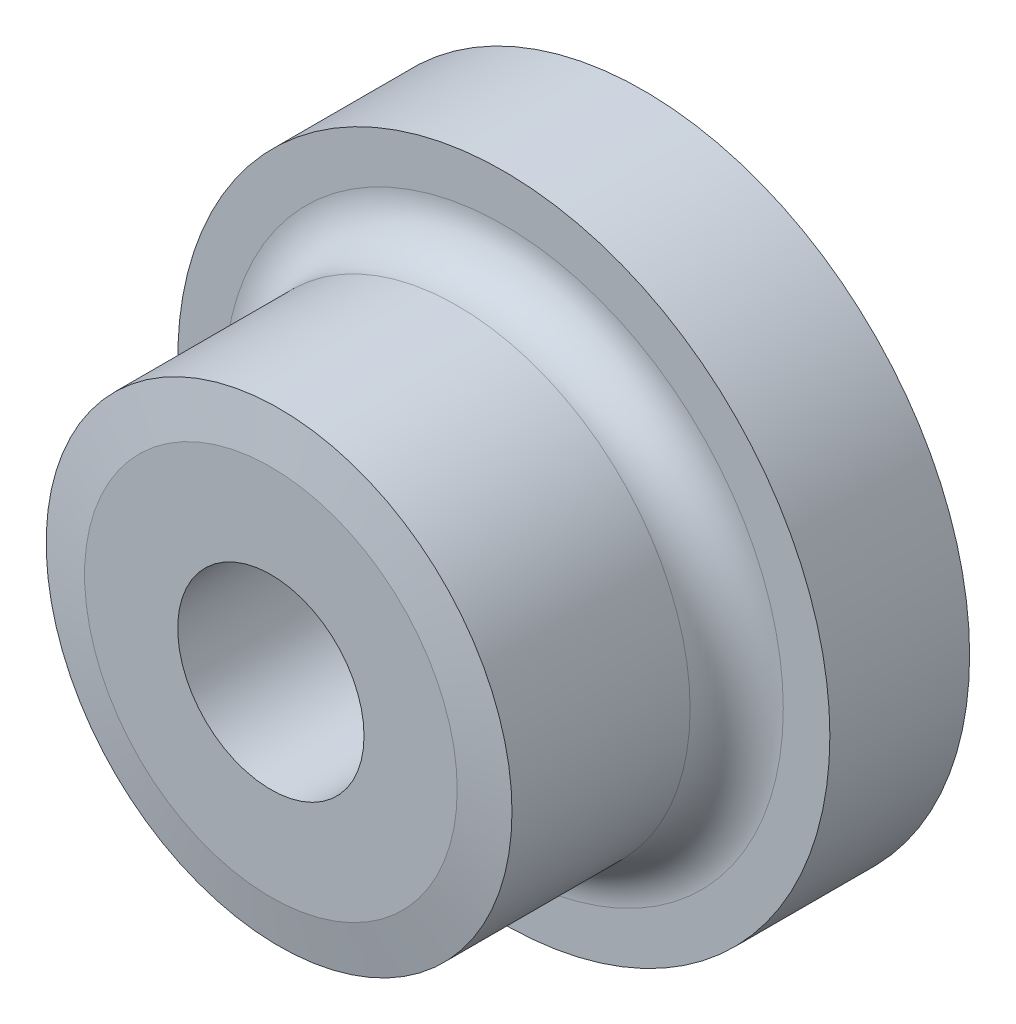
ISO-10303-21;
HEADER;
FILE_DESCRIPTION(('STEP AP214'),'2;1');
FILE_NAME('part.step','',(''),(''),'','','');
FILE_SCHEMA(('AUTOMOTIVE_DESIGN { 1 0 10303 214 1 1 1 1 }'));
ENDSEC;
DATA;
#1=APPLICATION_CONTEXT('core data for automotive mechanical design processes');
#2=APPLICATION_PROTOCOL_DEFINITION('international standard','automotive_design',2000,#1);
#3=PRODUCT_CONTEXT('',#1,'mechanical');
#4=PRODUCT('Part','Part','',(#3));
#5=PRODUCT_RELATED_PRODUCT_CATEGORY('part','',(#4));
#6=PRODUCT_DEFINITION_FORMATION('','',#4);
#7=PRODUCT_DEFINITION_CONTEXT('part definition',#1,'design');
#8=PRODUCT_DEFINITION('design','',#6,#7);
#9=PRODUCT_DEFINITION_SHAPE('','',#8);
#10=(LENGTH_UNIT() NAMED_UNIT(*) SI_UNIT(.MILLI.,.METRE.));
#11=(NAMED_UNIT(*) PLANE_ANGLE_UNIT() SI_UNIT($,.RADIAN.));
#12=(NAMED_UNIT(*) SI_UNIT($,.STERADIAN.) SOLID_ANGLE_UNIT());
#13=UNCERTAINTY_MEASURE_WITH_UNIT(LENGTH_MEASURE(1.E-05),#10,'distance_accuracy_value','');
#14=(GEOMETRIC_REPRESENTATION_CONTEXT(3) GLOBAL_UNCERTAINTY_ASSIGNED_CONTEXT((#13)) GLOBAL_UNIT_ASSIGNED_CONTEXT((#10,
#11,#12)) REPRESENTATION_CONTEXT('',''));
#15=CARTESIAN_POINT('',(0.,0.,0.));
#16=DIRECTION('',(0.,0.,1.));
#17=DIRECTION('',(1.,0.,0.));
#18=AXIS2_PLACEMENT_3D('',#15,#16,#17);
#19=CARTESIAN_POINT('',(0.,0.,3.));
#20=DIRECTION('',(0.,0.,-1.));
#21=DIRECTION('',(-1.,0.,0.));
#22=AXIS2_PLACEMENT_3D('',#19,#20,#21);
#23=CYLINDRICAL_SURFACE('',#22,7.);
#24=CARTESIAN_POINT('',(0.,0.,3.));
#25=DIRECTION('',(0.,0.,1.));
#26=DIRECTION('',(1.,0.,0.));
#27=AXIS2_PLACEMENT_3D('',#24,#25,#26);
#28=CIRCLE('',#27,7.);
#29=CARTESIAN_POINT('',(7.,0.,3.));
#30=VERTEX_POINT('',#29);
#31=EDGE_CURVE('E51',#30,#30,#28,.T.);
#32=ORIENTED_EDGE('',*,*,#31,.F.);
#33=EDGE_LOOP('',(#32));
#34=FACE_BOUND('',#33,.T.);
#35=CARTESIAN_POINT('',(0.,0.,0.));
#36=DIRECTION('',(0.,0.,1.));
#37=DIRECTION('',(1.,0.,0.));
#38=AXIS2_PLACEMENT_3D('',#35,#36,#37);
#39=CIRCLE('',#38,7.);
#40=CARTESIAN_POINT('',(7.,0.,0.));
#41=VERTEX_POINT('',#40);
#42=EDGE_CURVE('E52',#41,#41,#39,.T.);
#43=ORIENTED_EDGE('',*,*,#42,.T.);
#44=EDGE_LOOP('',(#43));
#45=FACE_BOUND('',#44,.T.);
#46=ADVANCED_FACE('F31',(#34,#45),#23,.T.);
#47=CARTESIAN_POINT('',(0.,0.,3.));
#48=DIRECTION('',(0.,0.,1.));
#49=DIRECTION('',(1.,0.,0.));
#50=AXIS2_PLACEMENT_3D('',#47,#48,#49);
#51=PLANE('',#50);
#52=CARTESIAN_POINT('',(0.,0.,3.));
#53=DIRECTION('',(0.,0.,1.));
#54=DIRECTION('',(1.,0.,0.));
#55=AXIS2_PLACEMENT_3D('',#52,#53,#54);
#56=CIRCLE('',#55,6.);
#57=CARTESIAN_POINT('',(6.,0.,3.));
#58=VERTEX_POINT('',#57);
#59=EDGE_CURVE('E42',#58,#58,#56,.F.);
#60=ORIENTED_EDGE('',*,*,#59,.T.);
#61=EDGE_LOOP('',(#60));
#62=FACE_BOUND('',#61,.T.);
#63=ORIENTED_EDGE('',*,*,#31,.T.);
#64=EDGE_LOOP('',(#63));
#65=FACE_BOUND('',#64,.T.);
#66=ADVANCED_FACE('F83',(#62,#65),#51,.T.);
#67=CARTESIAN_POINT('',(0.,0.,0.));
#68=DIRECTION('',(0.,0.,1.));
#69=DIRECTION('',(1.,0.,0.));
#70=AXIS2_PLACEMENT_3D('',#67,#68,#69);
#71=PLANE('',#70);
#72=CARTESIAN_POINT('',(0.,0.,0.));
#73=DIRECTION('',(0.,0.,1.));
#74=DIRECTION('',(1.,0.,0.));
#75=AXIS2_PLACEMENT_3D('',#72,#73,#74);
#76=CIRCLE('',#75,2.);
#77=CARTESIAN_POINT('',(2.,0.,0.));
#78=VERTEX_POINT('',#77);
#79=EDGE_CURVE('E55',#78,#78,#76,.T.);
#80=ORIENTED_EDGE('',*,*,#79,.T.);
#81=EDGE_LOOP('',(#80));
#82=FACE_BOUND('',#81,.T.);
#83=ORIENTED_EDGE('',*,*,#42,.F.);
#84=EDGE_LOOP('',(#83));
#85=FACE_BOUND('',#84,.T.);
#86=ADVANCED_FACE('F64',(#82,#85),#71,.F.);
#87=CARTESIAN_POINT('',(0.,0.,8.));
#88=DIRECTION('',(0.,0.,-1.));
#89=DIRECTION('',(-1.,0.,0.));
#90=AXIS2_PLACEMENT_3D('',#87,#88,#89);
#91=CYLINDRICAL_SURFACE('',#90,5.);
#92=CARTESIAN_POINT('',(0.,0.,7.82367301929153));
#93=DIRECTION('',(0.,0.,1.));
#94=DIRECTION('',(1.,0.,0.));
#95=AXIS2_PLACEMENT_3D('',#92,#93,#94);
#96=CIRCLE('',#95,5.);
#97=CARTESIAN_POINT('',(5.,0.,7.82367301929153));
#98=VERTEX_POINT('',#97);
#99=EDGE_CURVE('E10',#98,#98,#96,.F.);
#100=ORIENTED_EDGE('',*,*,#99,.T.);
#101=EDGE_LOOP('',(#100));
#102=FACE_BOUND('',#101,.T.);
#103=CARTESIAN_POINT('',(0.,0.,4.));
#104=DIRECTION('',(0.,0.,1.));
#105=DIRECTION('',(1.,0.,0.));
#106=AXIS2_PLACEMENT_3D('',#103,#104,#105);
#107=CIRCLE('',#106,5.);
#108=CARTESIAN_POINT('',(5.,0.,4.));
#109=VERTEX_POINT('',#108);
#110=EDGE_CURVE('E46',#109,#109,#107,.T.);
#111=ORIENTED_EDGE('',*,*,#110,.T.);
#112=EDGE_LOOP('',(#111));
#113=FACE_BOUND('',#112,.T.);
#114=ADVANCED_FACE('F76',(#102,#113),#91,.T.);
#115=CARTESIAN_POINT('',(0.,0.,8.));
#116=DIRECTION('',(0.,0.,1.));
#117=DIRECTION('',(1.,0.,0.));
#118=AXIS2_PLACEMENT_3D('',#115,#116,#117);
#119=PLANE('',#118);
#120=CARTESIAN_POINT('',(0.,0.,8.));
#121=DIRECTION('',(0.,0.,1.));
#122=DIRECTION('',(1.,0.,0.));
#123=AXIS2_PLACEMENT_3D('',#120,#121,#122);
#124=CIRCLE('',#123,3.99999999999998);
#125=CARTESIAN_POINT('',(3.99999999999998,0.,8.));
#126=VERTEX_POINT('',#125);
#127=EDGE_CURVE('E38',#126,#126,#124,.T.);
#128=ORIENTED_EDGE('',*,*,#127,.T.);
#129=EDGE_LOOP('',(#128));
#130=FACE_BOUND('',#129,.T.);
#131=CARTESIAN_POINT('',(0.,0.,8.));
#132=DIRECTION('',(0.,0.,1.));
#133=DIRECTION('',(1.,0.,0.));
#134=AXIS2_PLACEMENT_3D('',#131,#132,#133);
#135=CIRCLE('',#134,2.);
#136=CARTESIAN_POINT('',(2.,0.,8.));
#137=VERTEX_POINT('',#136);
#138=EDGE_CURVE('E58',#137,#137,#135,.T.);
#139=ORIENTED_EDGE('',*,*,#138,.F.);
#140=EDGE_LOOP('',(#139));
#141=FACE_BOUND('',#140,.T.);
#142=ADVANCED_FACE('F71',(#130,#141),#119,.T.);
#143=CARTESIAN_POINT('',(0.,0.,0.));
#144=DIRECTION('',(0.,0.,1.));
#145=DIRECTION('',(1.,0.,0.));
#146=AXIS2_PLACEMENT_3D('',#143,#144,#145);
#147=CYLINDRICAL_SURFACE('',#146,2.);
#148=ORIENTED_EDGE('',*,*,#79,.F.);
#149=EDGE_LOOP('',(#148));
#150=FACE_BOUND('',#149,.T.);
#151=ORIENTED_EDGE('',*,*,#138,.T.);
#152=EDGE_LOOP('',(#151));
#153=FACE_BOUND('',#152,.T.);
#154=ADVANCED_FACE('F67',(#150,#153),#147,.F.);
#155=CARTESIAN_POINT('',(0.,0.,4.));
#156=DIRECTION('',(0.,0.,1.));
#157=DIRECTION('',(1.,0.,0.));
#158=AXIS2_PLACEMENT_3D('',#155,#156,#157);
#159=TOROIDAL_SURFACE('',#158,6.,1.);
#160=ORIENTED_EDGE('',*,*,#59,.F.);
#161=EDGE_LOOP('',(#160));
#162=FACE_BOUND('',#161,.T.);
#163=ORIENTED_EDGE('',*,*,#110,.F.);
#164=EDGE_LOOP('',(#163));
#165=FACE_BOUND('',#164,.T.);
#166=ADVANCED_FACE('F70',(#162,#165),#159,.F.);
#167=CARTESIAN_POINT('',(0.,0.,8.));
#168=DIRECTION('',(0.,0.,-1.));
#169=DIRECTION('',(-1.,0.,0.));
#170=AXIS2_PLACEMENT_3D('',#167,#168,#169);
#171=CONICAL_SURFACE('',#170,3.99999999999998,1.39626340159547);
#172=ORIENTED_EDGE('',*,*,#99,.F.);
#173=EDGE_LOOP('',(#172));
#174=FACE_BOUND('',#173,.T.);
#175=ORIENTED_EDGE('',*,*,#127,.F.);
#176=EDGE_LOOP('',(#175));
#177=FACE_BOUND('',#176,.T.);
#178=ADVANCED_FACE('F33',(#174,#177),#171,.T.);
#179=CLOSED_SHELL('',(#46,#66,#86,#114,#142,#154,#166,#178));
#180=MANIFOLD_SOLID_BREP('B2',#179);
#181=ADVANCED_BREP_SHAPE_REPRESENTATION('',(#18,#180),#14);
#182=SHAPE_DEFINITION_REPRESENTATION(#9,#181);
ENDSEC;
END-ISO-10303-21;
